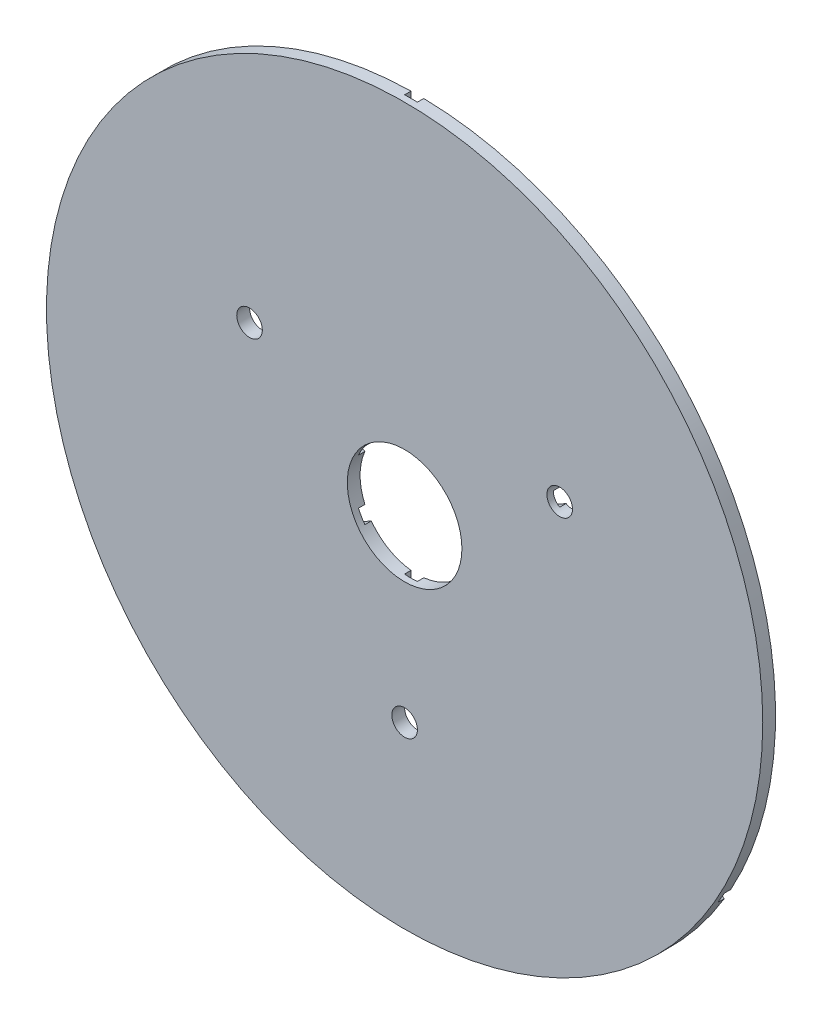
ISO-10303-21;
HEADER;
FILE_DESCRIPTION(('STEP AP214'),'2;1');
FILE_NAME('part.step','',(''),(''),'','','');
FILE_SCHEMA(('AUTOMOTIVE_DESIGN { 1 0 10303 214 1 1 1 1 }'));
ENDSEC;
DATA;
#1=APPLICATION_CONTEXT('core data for automotive mechanical design processes');
#2=APPLICATION_PROTOCOL_DEFINITION('international standard','automotive_design',2000,#1);
#3=PRODUCT_CONTEXT('',#1,'mechanical');
#4=PRODUCT('Part','Part','',(#3));
#5=PRODUCT_RELATED_PRODUCT_CATEGORY('part','',(#4));
#6=PRODUCT_DEFINITION_FORMATION('','',#4);
#7=PRODUCT_DEFINITION_CONTEXT('part definition',#1,'design');
#8=PRODUCT_DEFINITION('design','',#6,#7);
#9=PRODUCT_DEFINITION_SHAPE('','',#8);
#10=(LENGTH_UNIT() NAMED_UNIT(*) SI_UNIT(.MILLI.,.METRE.));
#11=(NAMED_UNIT(*) PLANE_ANGLE_UNIT() SI_UNIT($,.RADIAN.));
#12=(NAMED_UNIT(*) SI_UNIT($,.STERADIAN.) SOLID_ANGLE_UNIT());
#13=UNCERTAINTY_MEASURE_WITH_UNIT(LENGTH_MEASURE(1.E-05),#10,'distance_accuracy_value','');
#14=(GEOMETRIC_REPRESENTATION_CONTEXT(3) GLOBAL_UNCERTAINTY_ASSIGNED_CONTEXT((#13)) GLOBAL_UNIT_ASSIGNED_CONTEXT((#10,
#11,#12)) REPRESENTATION_CONTEXT('',''));
#15=CARTESIAN_POINT('',(0.,0.,0.));
#16=DIRECTION('',(0.,0.,1.));
#17=DIRECTION('',(1.,0.,0.));
#18=AXIS2_PLACEMENT_3D('',#15,#16,#17);
#19=CARTESIAN_POINT('',(0.,0.,1.5875));
#20=DIRECTION('',(0.,0.,-1.));
#21=DIRECTION('',(-1.,0.,0.));
#22=AXIS2_PLACEMENT_3D('',#19,#20,#21);
#23=PLANE('',#22);
#24=CARTESIAN_POINT('',(0.,0.,1.5875));
#25=DIRECTION('',(0.,0.,-1.));
#26=DIRECTION('',(-1.,0.,0.));
#27=AXIS2_PLACEMENT_3D('',#24,#25,#26);
#28=CIRCLE('',#27,14.224);
#29=CARTESIAN_POINT('',(-13.0351353306108,5.69275178737503,1.5875));
#30=VERTEX_POINT('',#29);
#31=CARTESIAN_POINT('',(-11.4476353306107,8.44238244439055,1.5875));
#32=VERTEX_POINT('',#31);
#33=EDGE_CURVE('E11',#30,#32,#28,.T.);
#34=ORIENTED_EDGE('',*,*,#33,.F.);
#35=DIRECTION('',(-0.866025403784435,0.500000000000005,0.));
#36=VECTOR('',#35,1.);
#37=CARTESIAN_POINT('',(-0.793749999999737,-1.37481532850732,1.5875));
#38=LINE('',#37,#36);
#39=CARTESIAN_POINT('',(-36.9073291982175,19.4753693429849,1.5875));
#40=VERTEX_POINT('',#39);
#41=EDGE_CURVE('E144',#30,#40,#38,.T.);
#42=ORIENTED_EDGE('',*,*,#41,.T.);
#43=CARTESIAN_POINT('',(-38.4948291982183,22.225,1.5875));
#44=DIRECTION('',(0.,0.,-1.));
#45=DIRECTION('',(-1.,0.,0.));
#46=AXIS2_PLACEMENT_3D('',#43,#44,#45);
#47=CIRCLE('',#46,3.175);
#48=CARTESIAN_POINT('',(-35.3198291982183,22.2250000000009,1.5875));
#49=VERTEX_POINT('',#48);
#50=EDGE_CURVE('E62',#49,#40,#47,.T.);
#51=ORIENTED_EDGE('',*,*,#50,.F.);
#52=DIRECTION('',(-0.866025403784435,0.500000000000005,0.));
#53=VECTOR('',#52,1.);
#54=CARTESIAN_POINT('',(0.793750000000282,1.37481532850826,1.5875));
#55=LINE('',#54,#53);
#56=EDGE_CURVE('E183',#32,#49,#55,.T.);
#57=ORIENTED_EDGE('',*,*,#56,.F.);
#58=EDGE_LOOP('',(#34,#42,#51,#57));
#59=FACE_BOUND('',#58,.T.);
#60=ADVANCED_FACE('F37',(#59),#23,.T.);
#61=CARTESIAN_POINT('',(-1.5875,14.1351342317645,1.5875));
#62=VERTEX_POINT('',#61);
#63=CARTESIAN_POINT('',(1.5875,14.1351342317645,1.5875));
#64=VERTEX_POINT('',#63);
#65=EDGE_CURVE('E46',#62,#64,#28,.T.);
#66=ORIENTED_EDGE('',*,*,#65,.F.);
#67=DIRECTION('',(0.,1.,0.));
#68=VECTOR('',#67,1.);
#69=CARTESIAN_POINT('',(-1.5875,0.,1.5875));
#70=LINE('',#69,#68);
#71=CARTESIAN_POINT('',(-1.5875,88.8858247627258,1.5875));
#72=VERTEX_POINT('',#71);
#73=EDGE_CURVE('E99',#62,#72,#70,.T.);
#74=ORIENTED_EDGE('',*,*,#73,.T.);
#75=CARTESIAN_POINT('',(0.,0.,1.5875));
#76=DIRECTION('',(0.,0.,-1.));
#77=DIRECTION('',(-1.,0.,0.));
#78=AXIS2_PLACEMENT_3D('',#75,#76,#77);
#79=CIRCLE('',#78,88.9);
#80=CARTESIAN_POINT('',(1.5875,88.8858247627258,1.5875));
#81=VERTEX_POINT('',#80);
#82=EDGE_CURVE('E299',#72,#81,#79,.T.);
#83=ORIENTED_EDGE('',*,*,#82,.T.);
#84=DIRECTION('',(0.,1.,0.));
#85=VECTOR('',#84,1.);
#86=CARTESIAN_POINT('',(1.5875,0.,1.5875));
#87=LINE('',#86,#85);
#88=EDGE_CURVE('E304',#64,#81,#87,.T.);
#89=ORIENTED_EDGE('',*,*,#88,.F.);
#90=EDGE_LOOP('',(#66,#74,#83,#89));
#91=FACE_BOUND('',#90,.T.);
#92=ADVANCED_FACE('F452',(#91),#23,.T.);
#93=CARTESIAN_POINT('',(11.4476353306107,8.44238244439055,1.5875));
#94=VERTEX_POINT('',#93);
#95=CARTESIAN_POINT('',(13.0351353306108,5.69275178737503,1.5875));
#96=VERTEX_POINT('',#95);
#97=EDGE_CURVE('E482',#94,#96,#28,.T.);
#98=ORIENTED_EDGE('',*,*,#97,.F.);
#99=DIRECTION('',(0.866025403784436,0.500000000000005,0.));
#100=VECTOR('',#99,1.);
#101=CARTESIAN_POINT('',(-0.793750000000285,1.37481532850827,1.5875));
#102=LINE('',#101,#100);
#103=CARTESIAN_POINT('',(35.3198291982183,22.2250000000009,1.5875));
#104=VERTEX_POINT('',#103);
#105=EDGE_CURVE('E306',#94,#104,#102,.T.);
#106=ORIENTED_EDGE('',*,*,#105,.T.);
#107=CARTESIAN_POINT('',(38.4948291982183,22.225,1.5875));
#108=DIRECTION('',(0.,0.,-1.));
#109=DIRECTION('',(-1.,0.,0.));
#110=AXIS2_PLACEMENT_3D('',#107,#108,#109);
#111=CIRCLE('',#110,3.175);
#112=CARTESIAN_POINT('',(36.9073291982175,19.4753693429849,1.5875));
#113=VERTEX_POINT('',#112);
#114=EDGE_CURVE('E309',#113,#104,#111,.T.);
#115=ORIENTED_EDGE('',*,*,#114,.F.);
#116=DIRECTION('',(0.866025403784436,0.500000000000005,0.));
#117=VECTOR('',#116,1.);
#118=CARTESIAN_POINT('',(0.793749999999734,-1.37481532850732,1.5875));
#119=LINE('',#118,#117);
#120=EDGE_CURVE('E311',#96,#113,#119,.T.);
#121=ORIENTED_EDGE('',*,*,#120,.F.);
#122=EDGE_LOOP('',(#98,#106,#115,#121));
#123=FACE_BOUND('',#122,.T.);
#124=ADVANCED_FACE('F457',(#123),#23,.T.);
#125=CARTESIAN_POINT('',(13.0351353306113,-5.69275178737402,1.5875));
#126=VERTEX_POINT('',#125);
#127=CARTESIAN_POINT('',(11.4476353306113,-8.44238244438967,1.5875));
#128=VERTEX_POINT('',#127);
#129=EDGE_CURVE('E480',#126,#128,#28,.T.);
#130=ORIENTED_EDGE('',*,*,#129,.F.);
#131=DIRECTION('',(-0.866025403784435,0.500000000000005,0.));
#132=VECTOR('',#131,1.);
#133=CARTESIAN_POINT('',(0.793750000000282,1.37481532850826,1.5875));
#134=LINE('',#133,#132);
#135=CARTESIAN_POINT('',(77.7711322808525,-43.0680970528551,1.5875));
#136=VERTEX_POINT('',#135);
#137=EDGE_CURVE('E314',#136,#126,#134,.T.);
#138=ORIENTED_EDGE('',*,*,#137,.F.);
#139=CARTESIAN_POINT('',(0.,0.,1.5875));
#140=DIRECTION('',(0.,0.,-1.));
#141=DIRECTION('',(-1.,0.,0.));
#142=AXIS2_PLACEMENT_3D('',#139,#140,#141);
#143=CIRCLE('',#142,88.9);
#144=CARTESIAN_POINT('',(76.1836322808525,-45.8177277098707,1.5875));
#145=VERTEX_POINT('',#144);
#146=EDGE_CURVE('E317',#136,#145,#143,.T.);
#147=ORIENTED_EDGE('',*,*,#146,.T.);
#148=DIRECTION('',(-0.866025403784435,0.500000000000005,0.));
#149=VECTOR('',#148,1.);
#150=CARTESIAN_POINT('',(-0.793749999999737,-1.37481532850732,1.5875));
#151=LINE('',#150,#149);
#152=EDGE_CURVE('E320',#145,#128,#151,.T.);
#153=ORIENTED_EDGE('',*,*,#152,.T.);
#154=EDGE_LOOP('',(#130,#138,#147,#153));
#155=FACE_BOUND('',#154,.T.);
#156=ADVANCED_FACE('F466',(#155),#23,.T.);
#157=CARTESIAN_POINT('',(1.5875,-14.1351342317645,1.5875));
#158=VERTEX_POINT('',#157);
#159=CARTESIAN_POINT('',(-1.5875,-14.1351342317645,1.5875));
#160=VERTEX_POINT('',#159);
#161=EDGE_CURVE('E334',#158,#160,#28,.T.);
#162=ORIENTED_EDGE('',*,*,#161,.F.);
#163=DIRECTION('',(0.,1.,0.));
#164=VECTOR('',#163,1.);
#165=CARTESIAN_POINT('',(1.5875,0.,1.5875));
#166=LINE('',#165,#164);
#167=CARTESIAN_POINT('',(1.5875,-41.7003693429844,1.5875));
#168=VERTEX_POINT('',#167);
#169=EDGE_CURVE('E323',#168,#158,#166,.T.);
#170=ORIENTED_EDGE('',*,*,#169,.F.);
#171=CARTESIAN_POINT('',(0.,-44.45,1.5875));
#172=DIRECTION('',(0.,0.,-1.));
#173=DIRECTION('',(-1.,0.,0.));
#174=AXIS2_PLACEMENT_3D('',#171,#172,#173);
#175=CIRCLE('',#174,3.175);
#176=CARTESIAN_POINT('',(-1.5875,-41.7003693429844,1.5875));
#177=VERTEX_POINT('',#176);
#178=EDGE_CURVE('E326',#177,#168,#175,.T.);
#179=ORIENTED_EDGE('',*,*,#178,.F.);
#180=DIRECTION('',(0.,1.,0.));
#181=VECTOR('',#180,1.);
#182=CARTESIAN_POINT('',(-1.5875,0.,1.5875));
#183=LINE('',#182,#181);
#184=EDGE_CURVE('E138',#177,#160,#183,.T.);
#185=ORIENTED_EDGE('',*,*,#184,.T.);
#186=EDGE_LOOP('',(#162,#170,#179,#185));
#187=FACE_BOUND('',#186,.T.);
#188=ADVANCED_FACE('F332',(#187),#23,.T.);
#189=CARTESIAN_POINT('',(0.,0.,3.175));
#190=DIRECTION('',(0.,0.,-1.));
#191=DIRECTION('',(-1.,0.,0.));
#192=AXIS2_PLACEMENT_3D('',#189,#190,#191);
#193=CYLINDRICAL_SURFACE('',#192,88.9);
#194=CARTESIAN_POINT('',(0.,0.,3.175));
#195=DIRECTION('',(0.,0.,1.));
#196=DIRECTION('',(1.,0.,0.));
#197=AXIS2_PLACEMENT_3D('',#194,#195,#196);
#198=CIRCLE('',#197,88.9);
#199=CARTESIAN_POINT('',(88.9,0.,3.175));
#200=VERTEX_POINT('',#199);
#201=EDGE_CURVE('E212',#200,#200,#198,.T.);
#202=ORIENTED_EDGE('',*,*,#201,.F.);
#203=EDGE_LOOP('',(#202));
#204=FACE_BOUND('',#203,.T.);
#205=DIRECTION('',(0.,0.,-1.));
#206=VECTOR('',#205,1.);
#207=CARTESIAN_POINT('',(1.5875,88.8858247627258,1.5875));
#208=LINE('',#207,#206);
#209=CARTESIAN_POINT('',(1.5875,88.8858247627258,0.));
#210=VERTEX_POINT('',#209);
#211=EDGE_CURVE('E207',#81,#210,#208,.T.);
#212=ORIENTED_EDGE('',*,*,#211,.F.);
#213=ORIENTED_EDGE('',*,*,#82,.F.);
#214=DIRECTION('',(0.,0.,-1.));
#215=VECTOR('',#214,1.);
#216=CARTESIAN_POINT('',(-1.5875,88.8858247627258,1.5875));
#217=LINE('',#216,#215);
#218=CARTESIAN_POINT('',(-1.5875,88.8858247627258,0.));
#219=VERTEX_POINT('',#218);
#220=EDGE_CURVE('E150',#72,#219,#217,.T.);
#221=ORIENTED_EDGE('',*,*,#220,.T.);
#222=CARTESIAN_POINT('',(0.,0.,0.));
#223=DIRECTION('',(0.,0.,1.));
#224=DIRECTION('',(1.,0.,0.));
#225=AXIS2_PLACEMENT_3D('',#222,#223,#224);
#226=CIRCLE('',#225,88.9);
#227=CARTESIAN_POINT('',(-77.7711322808525,-43.0680970528551,0.));
#228=VERTEX_POINT('',#227);
#229=EDGE_CURVE('E214',#219,#228,#226,.T.);
#230=ORIENTED_EDGE('',*,*,#229,.T.);
#231=DIRECTION('',(0.,0.,-1.));
#232=VECTOR('',#231,1.);
#233=CARTESIAN_POINT('',(-77.7711322808525,-43.0680970528551,1.5875));
#234=LINE('',#233,#232);
#235=CARTESIAN_POINT('',(-77.7711322808525,-43.0680970528551,1.5875));
#236=VERTEX_POINT('',#235);
#237=EDGE_CURVE('E90',#236,#228,#234,.T.);
#238=ORIENTED_EDGE('',*,*,#237,.F.);
#239=CARTESIAN_POINT('',(0.,0.,1.5875));
#240=DIRECTION('',(0.,0.,-1.));
#241=DIRECTION('',(-1.,0.,0.));
#242=AXIS2_PLACEMENT_3D('',#239,#240,#241);
#243=CIRCLE('',#242,88.9);
#244=CARTESIAN_POINT('',(-76.1836322808525,-45.8177277098707,1.5875));
#245=VERTEX_POINT('',#244);
#246=EDGE_CURVE('E137',#245,#236,#243,.T.);
#247=ORIENTED_EDGE('',*,*,#246,.F.);
#248=DIRECTION('',(0.,0.,-1.));
#249=VECTOR('',#248,1.);
#250=CARTESIAN_POINT('',(-76.1836322808525,-45.8177277098707,1.5875));
#251=LINE('',#250,#249);
#252=CARTESIAN_POINT('',(-76.1836322808525,-45.8177277098707,0.));
#253=VERTEX_POINT('',#252);
#254=EDGE_CURVE('E121',#245,#253,#251,.T.);
#255=ORIENTED_EDGE('',*,*,#254,.T.);
#256=CARTESIAN_POINT('',(76.1836322808525,-45.8177277098707,0.));
#257=VERTEX_POINT('',#256);
#258=EDGE_CURVE('E216',#253,#257,#226,.T.);
#259=ORIENTED_EDGE('',*,*,#258,.T.);
#260=DIRECTION('',(0.,0.,-1.));
#261=VECTOR('',#260,1.);
#262=CARTESIAN_POINT('',(76.1836322808525,-45.8177277098707,1.5875));
#263=LINE('',#262,#261);
#264=EDGE_CURVE('E196',#145,#257,#263,.T.);
#265=ORIENTED_EDGE('',*,*,#264,.F.);
#266=ORIENTED_EDGE('',*,*,#146,.F.);
#267=DIRECTION('',(0.,0.,-1.));
#268=VECTOR('',#267,1.);
#269=CARTESIAN_POINT('',(77.7711322808525,-43.0680970528551,1.5875));
#270=LINE('',#269,#268);
#271=CARTESIAN_POINT('',(77.7711322808525,-43.0680970528551,0.));
#272=VERTEX_POINT('',#271);
#273=EDGE_CURVE('E198',#136,#272,#270,.T.);
#274=ORIENTED_EDGE('',*,*,#273,.T.);
#275=EDGE_CURVE('E187',#272,#210,#226,.T.);
#276=ORIENTED_EDGE('',*,*,#275,.T.);
#277=EDGE_LOOP('',(#212,#213,#221,#230,#238,#247,#255,#259,#265,#266,#274,#276));
#278=FACE_BOUND('',#277,.T.);
#279=ADVANCED_FACE('F39',(#204,#278),#193,.T.);
#280=CARTESIAN_POINT('',(0.,0.,0.));
#281=DIRECTION('',(0.,0.,1.));
#282=DIRECTION('',(1.,0.,0.));
#283=AXIS2_PLACEMENT_3D('',#280,#281,#282);
#284=PLANE('',#283);
#285=DIRECTION('',(0.,1.,0.));
#286=VECTOR('',#285,1.);
#287=CARTESIAN_POINT('',(-1.5875,0.,0.));
#288=LINE('',#287,#286);
#289=CARTESIAN_POINT('',(-1.5875,-41.7003693429844,0.));
#290=VERTEX_POINT('',#289);
#291=CARTESIAN_POINT('',(-1.5875,-14.1351342317645,0.));
#292=VERTEX_POINT('',#291);
#293=EDGE_CURVE('E174',#290,#292,#288,.T.);
#294=ORIENTED_EDGE('',*,*,#293,.F.);
#295=CARTESIAN_POINT('',(0.,-44.45,0.));
#296=DIRECTION('',(0.,0.,-1.));
#297=DIRECTION('',(-1.,0.,0.));
#298=AXIS2_PLACEMENT_3D('',#295,#296,#297);
#299=CIRCLE('',#298,3.175);
#300=CARTESIAN_POINT('',(1.5875,-41.7003693429844,0.));
#301=VERTEX_POINT('',#300);
#302=EDGE_CURVE('E391',#301,#290,#299,.T.);
#303=ORIENTED_EDGE('',*,*,#302,.F.);
#304=DIRECTION('',(0.,1.,0.));
#305=VECTOR('',#304,1.);
#306=CARTESIAN_POINT('',(1.5875,0.,0.));
#307=LINE('',#306,#305);
#308=CARTESIAN_POINT('',(1.5875,-14.1351342317645,0.));
#309=VERTEX_POINT('',#308);
#310=EDGE_CURVE('E171',#301,#309,#307,.T.);
#311=ORIENTED_EDGE('',*,*,#310,.T.);
#312=CARTESIAN_POINT('',(0.,0.,0.));
#313=DIRECTION('',(0.,0.,1.));
#314=DIRECTION('',(1.,0.,0.));
#315=AXIS2_PLACEMENT_3D('',#312,#313,#314);
#316=CIRCLE('',#315,14.224);
#317=CARTESIAN_POINT('',(11.4476353306113,-8.44238244438967,0.));
#318=VERTEX_POINT('',#317);
#319=EDGE_CURVE('E398',#309,#318,#316,.T.);
#320=ORIENTED_EDGE('',*,*,#319,.T.);
#321=DIRECTION('',(-0.866025403784435,0.500000000000005,0.));
#322=VECTOR('',#321,1.);
#323=CARTESIAN_POINT('',(-0.793749999999737,-1.37481532850732,0.));
#324=LINE('',#323,#322);
#325=EDGE_CURVE('E168',#257,#318,#324,.T.);
#326=ORIENTED_EDGE('',*,*,#325,.F.);
#327=ORIENTED_EDGE('',*,*,#258,.F.);
#328=DIRECTION('',(0.866025403784436,0.500000000000005,0.));
#329=VECTOR('',#328,1.);
#330=CARTESIAN_POINT('',(0.793749999999734,-1.37481532850732,0.));
#331=LINE('',#330,#329);
#332=CARTESIAN_POINT('',(-11.4476353306113,-8.44238244438966,0.));
#333=VERTEX_POINT('',#332);
#334=EDGE_CURVE('E126',#253,#333,#331,.T.);
#335=ORIENTED_EDGE('',*,*,#334,.T.);
#336=EDGE_CURVE('E508',#333,#292,#316,.T.);
#337=ORIENTED_EDGE('',*,*,#336,.T.);
#338=EDGE_LOOP('',(#294,#303,#311,#320,#326,#327,#335,#337));
#339=FACE_BOUND('',#338,.T.);
#340=ADVANCED_FACE('F471',(#339),#284,.F.);
#341=DIRECTION('',(0.866025403784436,0.500000000000005,0.));
#342=VECTOR('',#341,1.);
#343=CARTESIAN_POINT('',(0.793749999999734,-1.37481532850732,0.));
#344=LINE('',#343,#342);
#345=CARTESIAN_POINT('',(13.0351353306108,5.69275178737503,0.));
#346=VERTEX_POINT('',#345);
#347=CARTESIAN_POINT('',(36.9073291982175,19.4753693429849,0.));
#348=VERTEX_POINT('',#347);
#349=EDGE_CURVE('E162',#346,#348,#344,.T.);
#350=ORIENTED_EDGE('',*,*,#349,.T.);
#351=CARTESIAN_POINT('',(38.4948291982183,22.225,0.));
#352=DIRECTION('',(0.,0.,-1.));
#353=DIRECTION('',(-1.,0.,0.));
#354=AXIS2_PLACEMENT_3D('',#351,#352,#353);
#355=CIRCLE('',#354,3.175);
#356=CARTESIAN_POINT('',(35.3198291982183,22.225,0.));
#357=VERTEX_POINT('',#356);
#358=EDGE_CURVE('E388',#357,#348,#355,.T.);
#359=ORIENTED_EDGE('',*,*,#358,.F.);
#360=DIRECTION('',(0.866025403784436,0.500000000000005,0.));
#361=VECTOR('',#360,1.);
#362=CARTESIAN_POINT('',(-0.793750000000285,1.37481532850827,0.));
#363=LINE('',#362,#361);
#364=CARTESIAN_POINT('',(11.4476353306107,8.44238244439055,0.));
#365=VERTEX_POINT('',#364);
#366=EDGE_CURVE('E159',#365,#357,#363,.T.);
#367=ORIENTED_EDGE('',*,*,#366,.F.);
#368=CARTESIAN_POINT('',(1.5875,14.1351342317645,0.));
#369=VERTEX_POINT('',#368);
#370=EDGE_CURVE('E368',#365,#369,#316,.T.);
#371=ORIENTED_EDGE('',*,*,#370,.T.);
#372=DIRECTION('',(0.,1.,0.));
#373=VECTOR('',#372,1.);
#374=CARTESIAN_POINT('',(1.5875,0.,0.));
#375=LINE('',#374,#373);
#376=EDGE_CURVE('E157',#369,#210,#375,.T.);
#377=ORIENTED_EDGE('',*,*,#376,.T.);
#378=ORIENTED_EDGE('',*,*,#275,.F.);
#379=DIRECTION('',(-0.866025403784435,0.500000000000005,0.));
#380=VECTOR('',#379,1.);
#381=CARTESIAN_POINT('',(0.793750000000282,1.37481532850826,0.));
#382=LINE('',#381,#380);
#383=CARTESIAN_POINT('',(13.0351353306113,-5.69275178737402,0.));
#384=VERTEX_POINT('',#383);
#385=EDGE_CURVE('E165',#272,#384,#382,.T.);
#386=ORIENTED_EDGE('',*,*,#385,.T.);
#387=EDGE_CURVE('E395',#384,#346,#316,.T.);
#388=ORIENTED_EDGE('',*,*,#387,.T.);
#389=EDGE_LOOP('',(#350,#359,#367,#371,#377,#378,#386,#388));
#390=FACE_BOUND('',#389,.T.);
#391=ADVANCED_FACE('F423',(#390),#284,.F.);
#392=CARTESIAN_POINT('',(0.,0.,3.175));
#393=DIRECTION('',(0.,0.,1.));
#394=DIRECTION('',(1.,0.,0.));
#395=AXIS2_PLACEMENT_3D('',#392,#393,#394);
#396=PLANE('',#395);
#397=CARTESIAN_POINT('',(38.4948291982183,22.225,3.175));
#398=DIRECTION('',(0.,0.,-1.));
#399=DIRECTION('',(-1.,0.,0.));
#400=AXIS2_PLACEMENT_3D('',#397,#398,#399);
#401=CIRCLE('',#400,3.175);
#402=CARTESIAN_POINT('',(35.3198291982183,22.225,3.175));
#403=VERTEX_POINT('',#402);
#404=EDGE_CURVE('E402',#403,#403,#401,.T.);
#405=ORIENTED_EDGE('',*,*,#404,.T.);
#406=EDGE_LOOP('',(#405));
#407=FACE_BOUND('',#406,.T.);
#408=CARTESIAN_POINT('',(-38.4948291982183,22.225,3.175));
#409=DIRECTION('',(0.,0.,-1.));
#410=DIRECTION('',(-1.,0.,0.));
#411=AXIS2_PLACEMENT_3D('',#408,#409,#410);
#412=CIRCLE('',#411,3.175);
#413=CARTESIAN_POINT('',(-41.6698291982183,22.225,3.175));
#414=VERTEX_POINT('',#413);
#415=EDGE_CURVE('E384',#414,#414,#412,.T.);
#416=ORIENTED_EDGE('',*,*,#415,.T.);
#417=EDGE_LOOP('',(#416));
#418=FACE_BOUND('',#417,.T.);
#419=CARTESIAN_POINT('',(0.,-44.45,3.175));
#420=DIRECTION('',(0.,0.,-1.));
#421=DIRECTION('',(-1.,0.,0.));
#422=AXIS2_PLACEMENT_3D('',#419,#420,#421);
#423=CIRCLE('',#422,3.175);
#424=CARTESIAN_POINT('',(-3.175,-44.45,3.175));
#425=VERTEX_POINT('',#424);
#426=EDGE_CURVE('E385',#425,#425,#423,.T.);
#427=ORIENTED_EDGE('',*,*,#426,.T.);
#428=EDGE_LOOP('',(#427));
#429=FACE_BOUND('',#428,.T.);
#430=CARTESIAN_POINT('',(0.,0.,3.175));
#431=DIRECTION('',(0.,0.,1.));
#432=DIRECTION('',(1.,0.,0.));
#433=AXIS2_PLACEMENT_3D('',#430,#431,#432);
#434=CIRCLE('',#433,14.224);
#435=CARTESIAN_POINT('',(14.224,0.,3.175));
#436=VERTEX_POINT('',#435);
#437=EDGE_CURVE('E399',#436,#436,#434,.T.);
#438=ORIENTED_EDGE('',*,*,#437,.F.);
#439=EDGE_LOOP('',(#438));
#440=FACE_BOUND('',#439,.T.);
#441=ORIENTED_EDGE('',*,*,#201,.T.);
#442=EDGE_LOOP('',(#441));
#443=FACE_BOUND('',#442,.T.);
#444=ADVANCED_FACE('F435',(#407,#418,#429,#440,#443),#396,.T.);
#445=DIRECTION('',(-0.866025403784435,0.500000000000005,0.));
#446=VECTOR('',#445,1.);
#447=CARTESIAN_POINT('',(0.793750000000282,1.37481532850826,0.));
#448=LINE('',#447,#446);
#449=CARTESIAN_POINT('',(-11.4476353306107,8.44238244439055,0.));
#450=VERTEX_POINT('',#449);
#451=CARTESIAN_POINT('',(-35.3198291982183,22.2250000000009,0.));
#452=VERTEX_POINT('',#451);
#453=EDGE_CURVE('E151',#450,#452,#448,.T.);
#454=ORIENTED_EDGE('',*,*,#453,.T.);
#455=CARTESIAN_POINT('',(-38.4948291982183,22.225,0.));
#456=DIRECTION('',(0.,0.,-1.));
#457=DIRECTION('',(-1.,0.,0.));
#458=AXIS2_PLACEMENT_3D('',#455,#456,#457);
#459=CIRCLE('',#458,3.175);
#460=CARTESIAN_POINT('',(-36.9073291982175,19.4753693429849,0.));
#461=VERTEX_POINT('',#460);
#462=EDGE_CURVE('E383',#461,#452,#459,.T.);
#463=ORIENTED_EDGE('',*,*,#462,.F.);
#464=DIRECTION('',(-0.866025403784435,0.500000000000005,0.));
#465=VECTOR('',#464,1.);
#466=CARTESIAN_POINT('',(-0.793749999999737,-1.37481532850732,0.));
#467=LINE('',#466,#465);
#468=CARTESIAN_POINT('',(-13.0351353306108,5.69275178737503,0.));
#469=VERTEX_POINT('',#468);
#470=EDGE_CURVE('E180',#469,#461,#467,.T.);
#471=ORIENTED_EDGE('',*,*,#470,.F.);
#472=CARTESIAN_POINT('',(-13.0351353306113,-5.69275178737401,0.));
#473=VERTEX_POINT('',#472);
#474=EDGE_CURVE('E229',#469,#473,#316,.T.);
#475=ORIENTED_EDGE('',*,*,#474,.T.);
#476=DIRECTION('',(0.866025403784436,0.500000000000005,0.));
#477=VECTOR('',#476,1.);
#478=CARTESIAN_POINT('',(-0.793750000000285,1.37481532850827,0.));
#479=LINE('',#478,#477);
#480=EDGE_CURVE('E178',#228,#473,#479,.T.);
#481=ORIENTED_EDGE('',*,*,#480,.F.);
#482=ORIENTED_EDGE('',*,*,#229,.F.);
#483=DIRECTION('',(0.,1.,0.));
#484=VECTOR('',#483,1.);
#485=CARTESIAN_POINT('',(-1.5875,0.,0.));
#486=LINE('',#485,#484);
#487=CARTESIAN_POINT('',(-1.5875,14.1351342317645,0.));
#488=VERTEX_POINT('',#487);
#489=EDGE_CURVE('E154',#488,#219,#486,.T.);
#490=ORIENTED_EDGE('',*,*,#489,.F.);
#491=EDGE_CURVE('E365',#488,#450,#316,.T.);
#492=ORIENTED_EDGE('',*,*,#491,.T.);
#493=EDGE_LOOP('',(#454,#463,#471,#475,#481,#482,#490,#492));
#494=FACE_BOUND('',#493,.T.);
#495=ADVANCED_FACE('F222',(#494),#284,.F.);
#496=CARTESIAN_POINT('',(0.793750000000282,1.37481532850826,1.5875));
#497=DIRECTION('',(-0.500000000000005,-0.866025403784435,0.));
#498=DIRECTION('',(0.866025403784435,-0.500000000000005,0.));
#499=AXIS2_PLACEMENT_3D('',#496,#497,#498);
#500=PLANE('',#499);
#501=DIRECTION('',(0.,0.,1.));
#502=VECTOR('',#501,1.);
#503=CARTESIAN_POINT('',(-11.4476353306107,8.44238244439055,0.));
#504=LINE('',#503,#502);
#505=EDGE_CURVE('E155',#32,#450,#504,.F.);
#506=ORIENTED_EDGE('',*,*,#505,.F.);
#507=ORIENTED_EDGE('',*,*,#56,.T.);
#508=DIRECTION('',(0.,0.,-1.));
#509=VECTOR('',#508,1.);
#510=CARTESIAN_POINT('',(-35.3198291982183,22.2250000000009,1.5875));
#511=LINE('',#510,#509);
#512=EDGE_CURVE('E184',#49,#452,#511,.T.);
#513=ORIENTED_EDGE('',*,*,#512,.T.);
#514=ORIENTED_EDGE('',*,*,#453,.F.);
#515=EDGE_LOOP('',(#506,#507,#513,#514));
#516=FACE_BOUND('',#515,.T.);
#517=ADVANCED_FACE('F295',(#516),#500,.T.);
#518=CARTESIAN_POINT('',(-0.793749999999737,-1.37481532850732,1.5875));
#519=DIRECTION('',(-0.500000000000005,-0.866025403784435,0.));
#520=DIRECTION('',(0.866025403784435,-0.500000000000005,0.));
#521=AXIS2_PLACEMENT_3D('',#518,#519,#520);
#522=PLANE('',#521);
#523=ORIENTED_EDGE('',*,*,#41,.F.);
#524=DIRECTION('',(0.,0.,1.));
#525=VECTOR('',#524,1.);
#526=CARTESIAN_POINT('',(-13.0351353306108,5.69275178737503,0.));
#527=LINE('',#526,#525);
#528=EDGE_CURVE('E282',#30,#469,#527,.F.);
#529=ORIENTED_EDGE('',*,*,#528,.T.);
#530=ORIENTED_EDGE('',*,*,#470,.T.);
#531=DIRECTION('',(0.,0.,-1.));
#532=VECTOR('',#531,1.);
#533=CARTESIAN_POINT('',(-36.9073291982175,19.4753693429849,1.5875));
#534=LINE('',#533,#532);
#535=EDGE_CURVE('E188',#40,#461,#534,.T.);
#536=ORIENTED_EDGE('',*,*,#535,.F.);
#537=EDGE_LOOP('',(#523,#529,#530,#536));
#538=FACE_BOUND('',#537,.T.);
#539=ADVANCED_FACE('F380',(#538),#522,.F.);
#540=CARTESIAN_POINT('',(-0.793750000000285,1.37481532850827,1.5875));
#541=DIRECTION('',(-0.500000000000005,0.866025403784436,0.));
#542=DIRECTION('',(-0.866025403784436,-0.500000000000005,0.));
#543=AXIS2_PLACEMENT_3D('',#540,#541,#542);
#544=PLANE('',#543);
#545=ORIENTED_EDGE('',*,*,#480,.T.);
#546=DIRECTION('',(0.,0.,1.));
#547=VECTOR('',#546,1.);
#548=CARTESIAN_POINT('',(-13.0351353306113,-5.69275178737401,0.));
#549=LINE('',#548,#547);
#550=CARTESIAN_POINT('',(-13.0351353306113,-5.69275178737401,1.5875));
#551=VERTEX_POINT('',#550);
#552=EDGE_CURVE('E234',#473,#551,#549,.T.);
#553=ORIENTED_EDGE('',*,*,#552,.T.);
#554=DIRECTION('',(0.866025403784436,0.500000000000005,0.));
#555=VECTOR('',#554,1.);
#556=CARTESIAN_POINT('',(-0.793750000000285,1.37481532850827,1.5875));
#557=LINE('',#556,#555);
#558=EDGE_CURVE('E142',#236,#551,#557,.T.);
#559=ORIENTED_EDGE('',*,*,#558,.F.);
#560=ORIENTED_EDGE('',*,*,#237,.T.);
#561=EDGE_LOOP('',(#545,#553,#559,#560));
#562=FACE_BOUND('',#561,.T.);
#563=ADVANCED_FACE('F231',(#562),#544,.F.);
#564=CARTESIAN_POINT('',(0.793749999999734,-1.37481532850732,1.5875));
#565=DIRECTION('',(-0.500000000000005,0.866025403784436,0.));
#566=DIRECTION('',(-0.866025403784436,-0.500000000000005,0.));
#567=AXIS2_PLACEMENT_3D('',#564,#565,#566);
#568=PLANE('',#567);
#569=DIRECTION('',(0.,0.,1.));
#570=VECTOR('',#569,1.);
#571=CARTESIAN_POINT('',(-11.4476353306113,-8.44238244438966,0.));
#572=LINE('',#571,#570);
#573=CARTESIAN_POINT('',(-11.4476353306113,-8.44238244438966,1.5875));
#574=VERTEX_POINT('',#573);
#575=EDGE_CURVE('E53',#333,#574,#572,.T.);
#576=ORIENTED_EDGE('',*,*,#575,.F.);
#577=ORIENTED_EDGE('',*,*,#334,.F.);
#578=ORIENTED_EDGE('',*,*,#254,.F.);
#579=DIRECTION('',(0.866025403784436,0.500000000000005,0.));
#580=VECTOR('',#579,1.);
#581=CARTESIAN_POINT('',(0.793749999999734,-1.37481532850732,1.5875));
#582=LINE('',#581,#580);
#583=EDGE_CURVE('E124',#245,#574,#582,.T.);
#584=ORIENTED_EDGE('',*,*,#583,.T.);
#585=EDGE_LOOP('',(#576,#577,#578,#584));
#586=FACE_BOUND('',#585,.T.);
#587=ADVANCED_FACE('F123',(#586),#568,.T.);
#588=CARTESIAN_POINT('',(-1.5875,0.,1.5875));
#589=DIRECTION('',(-1.,0.,0.));
#590=DIRECTION('',(0.,0.,1.));
#591=AXIS2_PLACEMENT_3D('',#588,#589,#590);
#592=PLANE('',#591);
#593=ORIENTED_EDGE('',*,*,#293,.T.);
#594=DIRECTION('',(0.,0.,1.));
#595=VECTOR('',#594,1.);
#596=CARTESIAN_POINT('',(-1.5875,-14.1351342317645,0.));
#597=LINE('',#596,#595);
#598=EDGE_CURVE('E342',#292,#160,#597,.T.);
#599=ORIENTED_EDGE('',*,*,#598,.T.);
#600=ORIENTED_EDGE('',*,*,#184,.F.);
#601=DIRECTION('',(0.,0.,-1.));
#602=VECTOR('',#601,1.);
#603=CARTESIAN_POINT('',(-1.5875,-41.7003693429844,1.5875));
#604=LINE('',#603,#602);
#605=EDGE_CURVE('E131',#177,#290,#604,.T.);
#606=ORIENTED_EDGE('',*,*,#605,.T.);
#607=EDGE_LOOP('',(#593,#599,#600,#606));
#608=FACE_BOUND('',#607,.T.);
#609=ADVANCED_FACE('F338',(#608),#592,.F.);
#610=CARTESIAN_POINT('',(1.5875,0.,1.5875));
#611=DIRECTION('',(-1.,0.,0.));
#612=DIRECTION('',(0.,0.,1.));
#613=AXIS2_PLACEMENT_3D('',#610,#611,#612);
#614=PLANE('',#613);
#615=DIRECTION('',(0.,0.,1.));
#616=VECTOR('',#615,1.);
#617=CARTESIAN_POINT('',(1.5875,-14.1351342317645,0.));
#618=LINE('',#617,#616);
#619=EDGE_CURVE('E405',#309,#158,#618,.T.);
#620=ORIENTED_EDGE('',*,*,#619,.F.);
#621=ORIENTED_EDGE('',*,*,#310,.F.);
#622=DIRECTION('',(0.,0.,-1.));
#623=VECTOR('',#622,1.);
#624=CARTESIAN_POINT('',(1.5875,-41.7003693429844,1.5875));
#625=LINE('',#624,#623);
#626=EDGE_CURVE('E193',#168,#301,#625,.T.);
#627=ORIENTED_EDGE('',*,*,#626,.F.);
#628=ORIENTED_EDGE('',*,*,#169,.T.);
#629=EDGE_LOOP('',(#620,#621,#627,#628));
#630=FACE_BOUND('',#629,.T.);
#631=ADVANCED_FACE('F506',(#630),#614,.T.);
#632=CARTESIAN_POINT('',(-0.793749999999737,-1.37481532850732,1.5875));
#633=DIRECTION('',(-0.500000000000005,-0.866025403784435,0.));
#634=DIRECTION('',(0.866025403784435,-0.500000000000005,0.));
#635=AXIS2_PLACEMENT_3D('',#632,#633,#634);
#636=PLANE('',#635);
#637=ORIENTED_EDGE('',*,*,#325,.T.);
#638=DIRECTION('',(0.,0.,1.));
#639=VECTOR('',#638,1.);
#640=CARTESIAN_POINT('',(11.4476353306113,-8.44238244438967,0.));
#641=LINE('',#640,#639);
#642=EDGE_CURVE('E410',#318,#128,#641,.T.);
#643=ORIENTED_EDGE('',*,*,#642,.T.);
#644=ORIENTED_EDGE('',*,*,#152,.F.);
#645=ORIENTED_EDGE('',*,*,#264,.T.);
#646=EDGE_LOOP('',(#637,#643,#644,#645));
#647=FACE_BOUND('',#646,.T.);
#648=ADVANCED_FACE('F510',(#647),#636,.F.);
#649=CARTESIAN_POINT('',(0.793750000000282,1.37481532850826,1.5875));
#650=DIRECTION('',(-0.500000000000005,-0.866025403784435,0.));
#651=DIRECTION('',(0.866025403784435,-0.500000000000005,0.));
#652=AXIS2_PLACEMENT_3D('',#649,#650,#651);
#653=PLANE('',#652);
#654=DIRECTION('',(0.,0.,1.));
#655=VECTOR('',#654,1.);
#656=CARTESIAN_POINT('',(13.0351353306113,-5.69275178737402,0.));
#657=LINE('',#656,#655);
#658=EDGE_CURVE('E408',#384,#126,#657,.T.);
#659=ORIENTED_EDGE('',*,*,#658,.F.);
#660=ORIENTED_EDGE('',*,*,#385,.F.);
#661=ORIENTED_EDGE('',*,*,#273,.F.);
#662=ORIENTED_EDGE('',*,*,#137,.T.);
#663=EDGE_LOOP('',(#659,#660,#661,#662));
#664=FACE_BOUND('',#663,.T.);
#665=ADVANCED_FACE('F485',(#664),#653,.T.);
#666=CARTESIAN_POINT('',(0.793749999999734,-1.37481532850732,1.5875));
#667=DIRECTION('',(-0.500000000000005,0.866025403784436,0.));
#668=DIRECTION('',(-0.866025403784436,-0.500000000000005,0.));
#669=AXIS2_PLACEMENT_3D('',#666,#667,#668);
#670=PLANE('',#669);
#671=DIRECTION('',(0.,0.,1.));
#672=VECTOR('',#671,1.);
#673=CARTESIAN_POINT('',(13.0351353306108,5.69275178737503,0.));
#674=LINE('',#673,#672);
#675=EDGE_CURVE('E373',#96,#346,#674,.F.);
#676=ORIENTED_EDGE('',*,*,#675,.F.);
#677=ORIENTED_EDGE('',*,*,#120,.T.);
#678=DIRECTION('',(0.,0.,-1.));
#679=VECTOR('',#678,1.);
#680=CARTESIAN_POINT('',(36.9073291982175,19.4753693429849,1.5875));
#681=LINE('',#680,#679);
#682=EDGE_CURVE('E201',#113,#348,#681,.T.);
#683=ORIENTED_EDGE('',*,*,#682,.T.);
#684=ORIENTED_EDGE('',*,*,#349,.F.);
#685=EDGE_LOOP('',(#676,#677,#683,#684));
#686=FACE_BOUND('',#685,.T.);
#687=ADVANCED_FACE('F493',(#686),#670,.T.);
#688=CARTESIAN_POINT('',(-0.793750000000285,1.37481532850827,1.5875));
#689=DIRECTION('',(-0.500000000000005,0.866025403784436,0.));
#690=DIRECTION('',(-0.866025403784436,-0.500000000000005,0.));
#691=AXIS2_PLACEMENT_3D('',#688,#689,#690);
#692=PLANE('',#691);
#693=ORIENTED_EDGE('',*,*,#105,.F.);
#694=DIRECTION('',(0.,0.,1.));
#695=VECTOR('',#694,1.);
#696=CARTESIAN_POINT('',(11.4476353306107,8.44238244439055,0.));
#697=LINE('',#696,#695);
#698=EDGE_CURVE('E376',#94,#365,#697,.F.);
#699=ORIENTED_EDGE('',*,*,#698,.T.);
#700=ORIENTED_EDGE('',*,*,#366,.T.);
#701=DIRECTION('',(0.,0.,-1.));
#702=VECTOR('',#701,1.);
#703=CARTESIAN_POINT('',(35.3198291982183,22.2250000000009,1.5875));
#704=LINE('',#703,#702);
#705=EDGE_CURVE('E204',#104,#357,#704,.T.);
#706=ORIENTED_EDGE('',*,*,#705,.F.);
#707=EDGE_LOOP('',(#693,#699,#700,#706));
#708=FACE_BOUND('',#707,.T.);
#709=ADVANCED_FACE('F416',(#708),#692,.F.);
#710=CARTESIAN_POINT('',(1.5875,0.,1.5875));
#711=DIRECTION('',(-1.,0.,0.));
#712=DIRECTION('',(0.,0.,1.));
#713=AXIS2_PLACEMENT_3D('',#710,#711,#712);
#714=PLANE('',#713);
#715=DIRECTION('',(0.,0.,1.));
#716=VECTOR('',#715,1.);
#717=CARTESIAN_POINT('',(1.5875,14.1351342317645,0.));
#718=LINE('',#717,#716);
#719=EDGE_CURVE('E372',#64,#369,#718,.F.);
#720=ORIENTED_EDGE('',*,*,#719,.F.);
#721=ORIENTED_EDGE('',*,*,#88,.T.);
#722=ORIENTED_EDGE('',*,*,#211,.T.);
#723=ORIENTED_EDGE('',*,*,#376,.F.);
#724=EDGE_LOOP('',(#720,#721,#722,#723));
#725=FACE_BOUND('',#724,.T.);
#726=ADVANCED_FACE('F463',(#725),#714,.T.);
#727=CARTESIAN_POINT('',(-1.5875,0.,1.5875));
#728=DIRECTION('',(-1.,0.,0.));
#729=DIRECTION('',(0.,0.,1.));
#730=AXIS2_PLACEMENT_3D('',#727,#728,#729);
#731=PLANE('',#730);
#732=ORIENTED_EDGE('',*,*,#73,.F.);
#733=DIRECTION('',(0.,0.,1.));
#734=VECTOR('',#733,1.);
#735=CARTESIAN_POINT('',(-1.5875,14.1351342317645,0.));
#736=LINE('',#735,#734);
#737=EDGE_CURVE('E367',#62,#488,#736,.F.);
#738=ORIENTED_EDGE('',*,*,#737,.T.);
#739=ORIENTED_EDGE('',*,*,#489,.T.);
#740=ORIENTED_EDGE('',*,*,#220,.F.);
#741=EDGE_LOOP('',(#732,#738,#739,#740));
#742=FACE_BOUND('',#741,.T.);
#743=ADVANCED_FACE('F371',(#742),#731,.F.);
#744=EDGE_CURVE('E41',#574,#551,#28,.T.);
#745=ORIENTED_EDGE('',*,*,#744,.F.);
#746=ORIENTED_EDGE('',*,*,#583,.F.);
#747=ORIENTED_EDGE('',*,*,#246,.T.);
#748=ORIENTED_EDGE('',*,*,#558,.T.);
#749=EDGE_LOOP('',(#745,#746,#747,#748));
#750=FACE_BOUND('',#749,.T.);
#751=ADVANCED_FACE('F135',(#750),#23,.T.);
#752=CARTESIAN_POINT('',(0.,0.,0.));
#753=DIRECTION('',(0.,0.,1.));
#754=DIRECTION('',(1.,0.,0.));
#755=AXIS2_PLACEMENT_3D('',#752,#753,#754);
#756=CYLINDRICAL_SURFACE('',#755,14.224);
#757=ORIENTED_EDGE('',*,*,#505,.T.);
#758=ORIENTED_EDGE('',*,*,#491,.F.);
#759=ORIENTED_EDGE('',*,*,#737,.F.);
#760=ORIENTED_EDGE('',*,*,#65,.T.);
#761=ORIENTED_EDGE('',*,*,#719,.T.);
#762=ORIENTED_EDGE('',*,*,#370,.F.);
#763=ORIENTED_EDGE('',*,*,#698,.F.);
#764=ORIENTED_EDGE('',*,*,#97,.T.);
#765=ORIENTED_EDGE('',*,*,#675,.T.);
#766=ORIENTED_EDGE('',*,*,#387,.F.);
#767=ORIENTED_EDGE('',*,*,#658,.T.);
#768=ORIENTED_EDGE('',*,*,#129,.T.);
#769=ORIENTED_EDGE('',*,*,#642,.F.);
#770=ORIENTED_EDGE('',*,*,#319,.F.);
#771=ORIENTED_EDGE('',*,*,#619,.T.);
#772=ORIENTED_EDGE('',*,*,#161,.T.);
#773=ORIENTED_EDGE('',*,*,#598,.F.);
#774=ORIENTED_EDGE('',*,*,#336,.F.);
#775=ORIENTED_EDGE('',*,*,#575,.T.);
#776=ORIENTED_EDGE('',*,*,#744,.T.);
#777=ORIENTED_EDGE('',*,*,#552,.F.);
#778=ORIENTED_EDGE('',*,*,#474,.F.);
#779=ORIENTED_EDGE('',*,*,#528,.F.);
#780=ORIENTED_EDGE('',*,*,#33,.T.);
#781=EDGE_LOOP('',(#757,#758,#759,#760,#761,#762,#763,#764,#765,#766,#767,#768,#769,#770,#771,
#772,#773,#774,#775,#776,#777,#778,#779,#780));
#782=FACE_BOUND('',#781,.T.);
#783=ORIENTED_EDGE('',*,*,#437,.T.);
#784=EDGE_LOOP('',(#783));
#785=FACE_BOUND('',#784,.T.);
#786=ADVANCED_FACE('F286',(#782,#785),#756,.F.);
#787=CARTESIAN_POINT('',(38.4948291982183,22.225,3.175));
#788=DIRECTION('',(0.,0.,-1.));
#789=DIRECTION('',(-1.,0.,0.));
#790=AXIS2_PLACEMENT_3D('',#787,#788,#789);
#791=CYLINDRICAL_SURFACE('',#790,3.175);
#792=ORIENTED_EDGE('',*,*,#682,.F.);
#793=ORIENTED_EDGE('',*,*,#114,.T.);
#794=ORIENTED_EDGE('',*,*,#705,.T.);
#795=ORIENTED_EDGE('',*,*,#358,.T.);
#796=EDGE_LOOP('',(#792,#793,#794,#795));
#797=FACE_BOUND('',#796,.T.);
#798=ORIENTED_EDGE('',*,*,#404,.F.);
#799=EDGE_LOOP('',(#798));
#800=FACE_BOUND('',#799,.T.);
#801=ADVANCED_FACE('F438',(#797,#800),#791,.F.);
#802=CARTESIAN_POINT('',(0.,-44.45,3.175));
#803=DIRECTION('',(0.,0.,-1.));
#804=DIRECTION('',(-1.,0.,0.));
#805=AXIS2_PLACEMENT_3D('',#802,#803,#804);
#806=CYLINDRICAL_SURFACE('',#805,3.175);
#807=ORIENTED_EDGE('',*,*,#426,.F.);
#808=EDGE_LOOP('',(#807));
#809=FACE_BOUND('',#808,.T.);
#810=ORIENTED_EDGE('',*,*,#178,.T.);
#811=ORIENTED_EDGE('',*,*,#626,.T.);
#812=ORIENTED_EDGE('',*,*,#302,.T.);
#813=ORIENTED_EDGE('',*,*,#605,.F.);
#814=EDGE_LOOP('',(#810,#811,#812,#813));
#815=FACE_BOUND('',#814,.T.);
#816=ADVANCED_FACE('F440',(#809,#815),#806,.F.);
#817=CARTESIAN_POINT('',(-38.4948291982183,22.225,3.175));
#818=DIRECTION('',(0.,0.,-1.));
#819=DIRECTION('',(-1.,0.,0.));
#820=AXIS2_PLACEMENT_3D('',#817,#818,#819);
#821=CYLINDRICAL_SURFACE('',#820,3.175);
#822=ORIENTED_EDGE('',*,*,#512,.F.);
#823=ORIENTED_EDGE('',*,*,#50,.T.);
#824=ORIENTED_EDGE('',*,*,#535,.T.);
#825=ORIENTED_EDGE('',*,*,#462,.T.);
#826=EDGE_LOOP('',(#822,#823,#824,#825));
#827=FACE_BOUND('',#826,.T.);
#828=ORIENTED_EDGE('',*,*,#415,.F.);
#829=EDGE_LOOP('',(#828));
#830=FACE_BOUND('',#829,.T.);
#831=ADVANCED_FACE('F446',(#827,#830),#821,.F.);
#832=CLOSED_SHELL('',(#60,#92,#124,#156,#188,#279,#340,#391,#444,#495,#517,#539,#563,#587,#609,
#631,#648,#665,#687,#709,#726,#743,#751,#786,#801,#816,#831));
#833=MANIFOLD_SOLID_BREP('B2',#832);
#834=ADVANCED_BREP_SHAPE_REPRESENTATION('',(#18,#833),#14);
#835=SHAPE_DEFINITION_REPRESENTATION(#9,#834);
ENDSEC;
END-ISO-10303-21;
